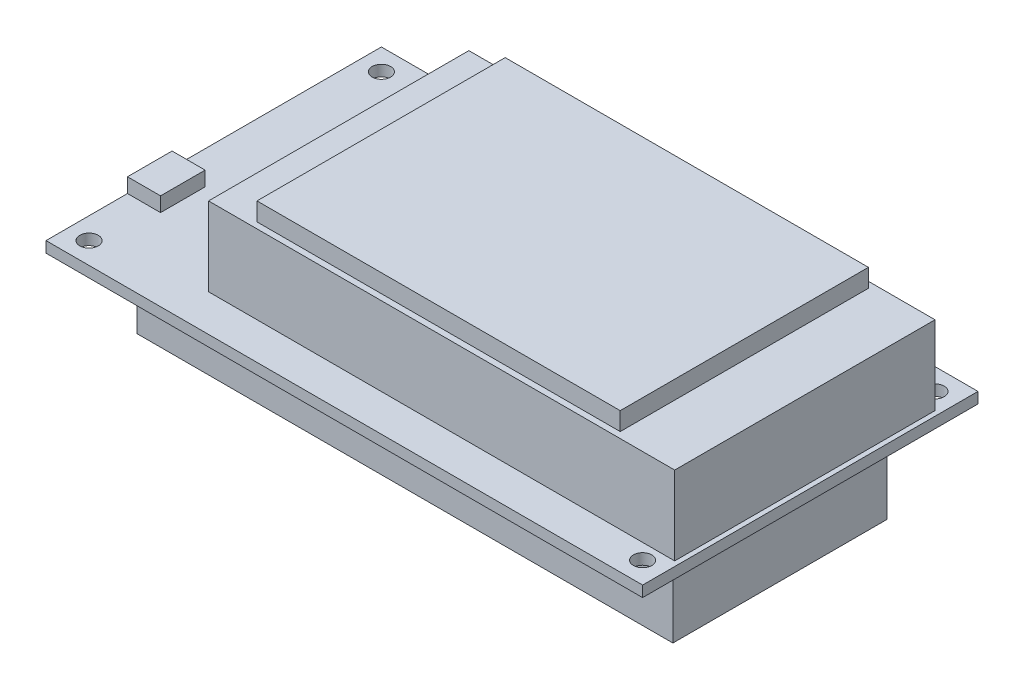
ISO-10303-21;
HEADER;
FILE_DESCRIPTION(('STEP AP214'),'2;1');
FILE_NAME('part.step','',(''),(''),'','','');
FILE_SCHEMA(('AUTOMOTIVE_DESIGN { 1 0 10303 214 1 1 1 1 }'));
ENDSEC;
DATA;
#1=APPLICATION_CONTEXT('core data for automotive mechanical design processes');
#2=APPLICATION_PROTOCOL_DEFINITION('international standard','automotive_design',2000,#1);
#3=PRODUCT_CONTEXT('',#1,'mechanical');
#4=PRODUCT('Part','Part','',(#3));
#5=PRODUCT_RELATED_PRODUCT_CATEGORY('part','',(#4));
#6=PRODUCT_DEFINITION_FORMATION('','',#4);
#7=PRODUCT_DEFINITION_CONTEXT('part definition',#1,'design');
#8=PRODUCT_DEFINITION('design','',#6,#7);
#9=PRODUCT_DEFINITION_SHAPE('','',#8);
#10=(LENGTH_UNIT() NAMED_UNIT(*) SI_UNIT(.MILLI.,.METRE.));
#11=(NAMED_UNIT(*) PLANE_ANGLE_UNIT() SI_UNIT($,.RADIAN.));
#12=(NAMED_UNIT(*) SI_UNIT($,.STERADIAN.) SOLID_ANGLE_UNIT());
#13=UNCERTAINTY_MEASURE_WITH_UNIT(LENGTH_MEASURE(1.E-05),#10,'distance_accuracy_value','');
#14=(GEOMETRIC_REPRESENTATION_CONTEXT(3) GLOBAL_UNCERTAINTY_ASSIGNED_CONTEXT((#13)) GLOBAL_UNIT_ASSIGNED_CONTEXT((#10,
#11,#12)) REPRESENTATION_CONTEXT('',''));
#15=CARTESIAN_POINT('',(0.,0.,0.));
#16=DIRECTION('',(0.,0.,1.));
#17=DIRECTION('',(1.,0.,0.));
#18=AXIS2_PLACEMENT_3D('',#15,#16,#17);
#19=CARTESIAN_POINT('',(0.,4.2,-13.46));
#20=DIRECTION('',(1.,0.,0.));
#21=DIRECTION('',(0.,0.,-1.));
#22=AXIS2_PLACEMENT_3D('',#19,#20,#21);
#23=PLANE('',#22);
#24=DIRECTION('',(0.,0.,1.));
#25=VECTOR('',#24,1.);
#26=CARTESIAN_POINT('',(0.,1.8,-13.46));
#27=LINE('',#26,#25);
#28=CARTESIAN_POINT('',(0.,1.8,-20.826));
#29=VERTEX_POINT('',#28);
#30=CARTESIAN_POINT('',(0.,1.8,-13.46));
#31=VERTEX_POINT('',#30);
#32=EDGE_CURVE('E110',#29,#31,#27,.T.);
#33=ORIENTED_EDGE('',*,*,#32,.T.);
#34=DIRECTION('',(0.,-1.,0.));
#35=VECTOR('',#34,1.);
#36=CARTESIAN_POINT('',(0.,4.2,-13.46));
#37=LINE('',#36,#35);
#38=CARTESIAN_POINT('',(0.,4.2,-13.46));
#39=VERTEX_POINT('',#38);
#40=EDGE_CURVE('E12',#39,#31,#37,.T.);
#41=ORIENTED_EDGE('',*,*,#40,.F.);
#42=DIRECTION('',(0.,0.,1.));
#43=VECTOR('',#42,1.);
#44=CARTESIAN_POINT('',(0.,4.2,-13.46));
#45=LINE('',#44,#43);
#46=CARTESIAN_POINT('',(0.,4.2,-20.826));
#47=VERTEX_POINT('',#46);
#48=EDGE_CURVE('E98',#47,#39,#45,.T.);
#49=ORIENTED_EDGE('',*,*,#48,.F.);
#50=DIRECTION('',(0.,-1.,0.));
#51=VECTOR('',#50,1.);
#52=CARTESIAN_POINT('',(0.,4.2,-20.826));
#53=LINE('',#52,#51);
#54=EDGE_CURVE('E106',#47,#29,#53,.T.);
#55=ORIENTED_EDGE('',*,*,#54,.T.);
#56=EDGE_LOOP('',(#33,#41,#49,#55));
#57=FACE_BOUND('',#56,.T.);
#58=ADVANCED_FACE('F47',(#57),#23,.F.);
#59=CARTESIAN_POINT('',(0.,4.2,-13.46));
#60=DIRECTION('',(0.,0.,-1.));
#61=DIRECTION('',(-1.,0.,0.));
#62=AXIS2_PLACEMENT_3D('',#59,#60,#61);
#63=PLANE('',#62);
#64=DIRECTION('',(1.,0.,0.));
#65=VECTOR('',#64,1.);
#66=CARTESIAN_POINT('',(0.,1.8,-13.46));
#67=LINE('',#66,#65);
#68=CARTESIAN_POINT('',(5.46,1.8,-13.46));
#69=VERTEX_POINT('',#68);
#70=EDGE_CURVE('E102',#31,#69,#67,.T.);
#71=ORIENTED_EDGE('',*,*,#70,.T.);
#72=DIRECTION('',(0.,-1.,0.));
#73=VECTOR('',#72,1.);
#74=CARTESIAN_POINT('',(5.46,4.2,-13.46));
#75=LINE('',#74,#73);
#76=CARTESIAN_POINT('',(5.46,4.2,-13.46));
#77=VERTEX_POINT('',#76);
#78=EDGE_CURVE('E55',#77,#69,#75,.T.);
#79=ORIENTED_EDGE('',*,*,#78,.F.);
#80=DIRECTION('',(1.,0.,0.));
#81=VECTOR('',#80,1.);
#82=CARTESIAN_POINT('',(0.,4.2,-13.46));
#83=LINE('',#82,#81);
#84=EDGE_CURVE('E93',#39,#77,#83,.T.);
#85=ORIENTED_EDGE('',*,*,#84,.F.);
#86=ORIENTED_EDGE('',*,*,#40,.T.);
#87=EDGE_LOOP('',(#71,#79,#85,#86));
#88=FACE_BOUND('',#87,.T.);
#89=ADVANCED_FACE('F101',(#88),#63,.F.);
#90=CARTESIAN_POINT('',(5.46,4.2,-13.46));
#91=DIRECTION('',(-1.,0.,0.));
#92=DIRECTION('',(0.,0.,1.));
#93=AXIS2_PLACEMENT_3D('',#90,#91,#92);
#94=PLANE('',#93);
#95=DIRECTION('',(0.,0.,-1.));
#96=VECTOR('',#95,1.);
#97=CARTESIAN_POINT('',(5.46,1.8,-13.46));
#98=LINE('',#97,#96);
#99=CARTESIAN_POINT('',(5.46,1.8,-20.826));
#100=VERTEX_POINT('',#99);
#101=EDGE_CURVE('E80',#69,#100,#98,.T.);
#102=ORIENTED_EDGE('',*,*,#101,.T.);
#103=DIRECTION('',(0.,-1.,0.));
#104=VECTOR('',#103,1.);
#105=CARTESIAN_POINT('',(5.46,4.2,-20.826));
#106=LINE('',#105,#104);
#107=CARTESIAN_POINT('',(5.46,4.2,-20.826));
#108=VERTEX_POINT('',#107);
#109=EDGE_CURVE('E103',#108,#100,#106,.T.);
#110=ORIENTED_EDGE('',*,*,#109,.F.);
#111=DIRECTION('',(0.,0.,-1.));
#112=VECTOR('',#111,1.);
#113=CARTESIAN_POINT('',(5.46,4.2,-13.46));
#114=LINE('',#113,#112);
#115=EDGE_CURVE('E96',#77,#108,#114,.T.);
#116=ORIENTED_EDGE('',*,*,#115,.F.);
#117=ORIENTED_EDGE('',*,*,#78,.T.);
#118=EDGE_LOOP('',(#102,#110,#116,#117));
#119=FACE_BOUND('',#118,.T.);
#120=ADVANCED_FACE('F104',(#119),#94,.F.);
#121=CARTESIAN_POINT('',(0.,4.2,-20.826));
#122=DIRECTION('',(0.,0.,1.));
#123=DIRECTION('',(1.,0.,0.));
#124=AXIS2_PLACEMENT_3D('',#121,#122,#123);
#125=PLANE('',#124);
#126=DIRECTION('',(-1.,0.,0.));
#127=VECTOR('',#126,1.);
#128=CARTESIAN_POINT('',(0.,1.8,-20.826));
#129=LINE('',#128,#127);
#130=EDGE_CURVE('E86',#100,#29,#129,.T.);
#131=ORIENTED_EDGE('',*,*,#130,.T.);
#132=ORIENTED_EDGE('',*,*,#54,.F.);
#133=DIRECTION('',(-1.,0.,0.));
#134=VECTOR('',#133,1.);
#135=CARTESIAN_POINT('',(0.,4.2,-20.826));
#136=LINE('',#135,#134);
#137=EDGE_CURVE('E63',#108,#47,#136,.T.);
#138=ORIENTED_EDGE('',*,*,#137,.F.);
#139=ORIENTED_EDGE('',*,*,#109,.T.);
#140=EDGE_LOOP('',(#131,#132,#138,#139));
#141=FACE_BOUND('',#140,.T.);
#142=ADVANCED_FACE('F117',(#141),#125,.F.);
#143=CARTESIAN_POINT('',(0.,4.2,0.));
#144=DIRECTION('',(0.,-1.,0.));
#145=DIRECTION('',(0.,0.,-1.));
#146=AXIS2_PLACEMENT_3D('',#143,#144,#145);
#147=PLANE('',#146);
#148=ORIENTED_EDGE('',*,*,#48,.T.);
#149=ORIENTED_EDGE('',*,*,#84,.T.);
#150=ORIENTED_EDGE('',*,*,#115,.T.);
#151=ORIENTED_EDGE('',*,*,#137,.T.);
#152=EDGE_LOOP('',(#148,#149,#150,#151));
#153=FACE_BOUND('',#152,.T.);
#154=ADVANCED_FACE('F94',(#153),#147,.F.);
#155=CARTESIAN_POINT('',(0.,1.8,0.));
#156=DIRECTION('',(0.,-1.,0.));
#157=DIRECTION('',(0.,0.,-1.));
#158=AXIS2_PLACEMENT_3D('',#155,#156,#157);
#159=PLANE('',#158);
#160=ORIENTED_EDGE('',*,*,#32,.F.);
#161=ORIENTED_EDGE('',*,*,#130,.F.);
#162=ORIENTED_EDGE('',*,*,#101,.F.);
#163=ORIENTED_EDGE('',*,*,#70,.F.);
#164=EDGE_LOOP('',(#160,#161,#162,#163));
#165=FACE_BOUND('',#164,.T.);
#166=ADVANCED_FACE('F120',(#165),#159,.T.);
#167=CLOSED_SHELL('',(#58,#89,#120,#142,#154,#166));
#168=MANIFOLD_SOLID_BREP('B2',#167);
#169=CARTESIAN_POINT('',(0.,0.,0.));
#170=DIRECTION('',(0.,-1.,0.));
#171=DIRECTION('',(0.,0.,-1.));
#172=AXIS2_PLACEMENT_3D('',#169,#170,#171);
#173=PLANE('',#172);
#174=CARTESIAN_POINT('',(94.9959999999998,0.,-51.8460000000013));
#175=DIRECTION('',(0.,1.,0.));
#176=DIRECTION('',(0.,0.,1.));
#177=AXIS2_PLACEMENT_3D('',#174,#175,#176);
#178=CIRCLE('',#177,1.52399999999999);
#179=CARTESIAN_POINT('',(94.9959999999998,0.,-50.3220000000013));
#180=VERTEX_POINT('',#179);
#181=EDGE_CURVE('E380',#180,#180,#178,.T.);
#182=ORIENTED_EDGE('',*,*,#181,.T.);
#183=EDGE_LOOP('',(#182));
#184=FACE_BOUND('',#183,.T.);
#185=CARTESIAN_POINT('',(3.556,0.,-3.556));
#186=DIRECTION('',(0.,1.,0.));
#187=DIRECTION('',(0.,0.,1.));
#188=AXIS2_PLACEMENT_3D('',#185,#186,#187);
#189=CIRCLE('',#188,1.524);
#190=CARTESIAN_POINT('',(3.556,0.,-2.032));
#191=VERTEX_POINT('',#190);
#192=EDGE_CURVE('E392',#191,#191,#189,.T.);
#193=ORIENTED_EDGE('',*,*,#192,.T.);
#194=EDGE_LOOP('',(#193));
#195=FACE_BOUND('',#194,.T.);
#196=DIRECTION('',(0.,0.,1.));
#197=VECTOR('',#196,1.);
#198=CARTESIAN_POINT('',(0.,0.,0.));
#199=LINE('',#198,#197);
#200=CARTESIAN_POINT('',(0.,0.,-55.4));
#201=VERTEX_POINT('',#200);
#202=CARTESIAN_POINT('',(0.,0.,0.));
#203=VERTEX_POINT('',#202);
#204=EDGE_CURVE('E398',#201,#203,#199,.T.);
#205=ORIENTED_EDGE('',*,*,#204,.F.);
#206=DIRECTION('',(-1.,0.,0.));
#207=VECTOR('',#206,1.);
#208=CARTESIAN_POINT('',(0.,0.,-55.4));
#209=LINE('',#208,#207);
#210=CARTESIAN_POINT('',(98.55,0.,-55.4));
#211=VERTEX_POINT('',#210);
#212=EDGE_CURVE('E405',#211,#201,#209,.T.);
#213=ORIENTED_EDGE('',*,*,#212,.F.);
#214=DIRECTION('',(0.,0.,-1.));
#215=VECTOR('',#214,1.);
#216=CARTESIAN_POINT('',(98.55,0.,0.));
#217=LINE('',#216,#215);
#218=CARTESIAN_POINT('',(98.55,0.,0.));
#219=VERTEX_POINT('',#218);
#220=EDGE_CURVE('E416',#219,#211,#217,.T.);
#221=ORIENTED_EDGE('',*,*,#220,.F.);
#222=DIRECTION('',(1.,0.,0.));
#223=VECTOR('',#222,1.);
#224=CARTESIAN_POINT('',(0.,0.,0.));
#225=LINE('',#224,#223);
#226=EDGE_CURVE('E414',#203,#219,#225,.T.);
#227=ORIENTED_EDGE('',*,*,#226,.F.);
#228=EDGE_LOOP('',(#205,#213,#221,#227));
#229=FACE_BOUND('',#228,.T.);
#230=CARTESIAN_POINT('',(94.996,0.,-3.55600000000128));
#231=DIRECTION('',(0.,1.,0.));
#232=DIRECTION('',(0.,0.,1.));
#233=AXIS2_PLACEMENT_3D('',#230,#231,#232);
#234=CIRCLE('',#233,1.52399999999999);
#235=CARTESIAN_POINT('',(94.996,0.,-2.03200000000129));
#236=VERTEX_POINT('',#235);
#237=EDGE_CURVE('E386',#236,#236,#234,.T.);
#238=ORIENTED_EDGE('',*,*,#237,.T.);
#239=EDGE_LOOP('',(#238));
#240=FACE_BOUND('',#239,.T.);
#241=CARTESIAN_POINT('',(3.55599999999984,0.,-51.846));
#242=DIRECTION('',(0.,1.,0.));
#243=DIRECTION('',(0.,0.,1.));
#244=AXIS2_PLACEMENT_3D('',#241,#242,#243);
#245=CIRCLE('',#244,1.524);
#246=CARTESIAN_POINT('',(3.55599999999984,0.,-50.322));
#247=VERTEX_POINT('',#246);
#248=EDGE_CURVE('E376',#247,#247,#245,.T.);
#249=ORIENTED_EDGE('',*,*,#248,.T.);
#250=EDGE_LOOP('',(#249));
#251=FACE_BOUND('',#250,.T.);
#252=DIRECTION('',(1.,0.,0.));
#253=VECTOR('',#252,1.);
#254=CARTESIAN_POINT('',(5.,0.,-45.4));
#255=LINE('',#254,#253);
#256=CARTESIAN_POINT('',(5.,0.,-45.4));
#257=VERTEX_POINT('',#256);
#258=CARTESIAN_POINT('',(93.55,0.,-45.4));
#259=VERTEX_POINT('',#258);
#260=EDGE_CURVE('E692',#257,#259,#255,.T.);
#261=ORIENTED_EDGE('',*,*,#260,.F.);
#262=DIRECTION('',(0.,0.,-1.));
#263=VECTOR('',#262,1.);
#264=CARTESIAN_POINT('',(4.99999999999999,0.,-10.));
#265=LINE('',#264,#263);
#266=CARTESIAN_POINT('',(4.99999999999999,0.,-10.));
#267=VERTEX_POINT('',#266);
#268=EDGE_CURVE('E307',#267,#257,#265,.T.);
#269=ORIENTED_EDGE('',*,*,#268,.F.);
#270=DIRECTION('',(-1.,0.,0.));
#271=VECTOR('',#270,1.);
#272=CARTESIAN_POINT('',(4.99999999999999,0.,-10.));
#273=LINE('',#272,#271);
#274=CARTESIAN_POINT('',(93.55,0.,-10.));
#275=VERTEX_POINT('',#274);
#276=EDGE_CURVE('E303',#275,#267,#273,.T.);
#277=ORIENTED_EDGE('',*,*,#276,.F.);
#278=DIRECTION('',(0.,0.,1.));
#279=VECTOR('',#278,1.);
#280=CARTESIAN_POINT('',(93.55,0.,-10.));
#281=LINE('',#280,#279);
#282=EDGE_CURVE('E694',#259,#275,#281,.T.);
#283=ORIENTED_EDGE('',*,*,#282,.F.);
#284=EDGE_LOOP('',(#261,#269,#277,#283));
#285=FACE_BOUND('',#284,.T.);
#286=ADVANCED_FACE('F171',(#184,#195,#229,#240,#251,#285),#173,.T.);
#287=CARTESIAN_POINT('',(0.,14.8,0.));
#288=DIRECTION('',(0.,-1.,0.));
#289=DIRECTION('',(0.,0.,-1.));
#290=AXIS2_PLACEMENT_3D('',#287,#288,#289);
#291=PLANE('',#290);
#292=DIRECTION('',(0.,0.,-1.));
#293=VECTOR('',#292,1.);
#294=CARTESIAN_POINT('',(97.75,14.8,-49.1));
#295=LINE('',#294,#293);
#296=CARTESIAN_POINT('',(97.75,14.8,-6.1));
#297=VERTEX_POINT('',#296);
#298=CARTESIAN_POINT('',(97.75,14.8,-49.1));
#299=VERTEX_POINT('',#298);
#300=EDGE_CURVE('E344',#297,#299,#295,.T.);
#301=ORIENTED_EDGE('',*,*,#300,.T.);
#302=DIRECTION('',(-1.,0.,0.));
#303=VECTOR('',#302,1.);
#304=CARTESIAN_POINT('',(97.75,14.8,-49.1));
#305=LINE('',#304,#303);
#306=CARTESIAN_POINT('',(20.75,14.8,-49.1));
#307=VERTEX_POINT('',#306);
#308=EDGE_CURVE('E347',#299,#307,#305,.T.);
#309=ORIENTED_EDGE('',*,*,#308,.T.);
#310=DIRECTION('',(0.,0.,1.));
#311=VECTOR('',#310,1.);
#312=CARTESIAN_POINT('',(20.75,14.8,-49.1));
#313=LINE('',#312,#311);
#314=CARTESIAN_POINT('',(20.75,14.8,-6.09999999999999));
#315=VERTEX_POINT('',#314);
#316=EDGE_CURVE('E350',#307,#315,#313,.T.);
#317=ORIENTED_EDGE('',*,*,#316,.T.);
#318=DIRECTION('',(1.,0.,0.));
#319=VECTOR('',#318,1.);
#320=CARTESIAN_POINT('',(97.75,14.8,-6.1));
#321=LINE('',#320,#319);
#322=EDGE_CURVE('E352',#315,#297,#321,.T.);
#323=ORIENTED_EDGE('',*,*,#322,.T.);
#324=EDGE_LOOP('',(#301,#309,#317,#323));
#325=FACE_BOUND('',#324,.T.);
#326=DIRECTION('',(0.,0.,1.));
#327=VECTOR('',#326,1.);
#328=CARTESIAN_POINT('',(27.75,14.8,-48.1));
#329=LINE('',#328,#327);
#330=CARTESIAN_POINT('',(27.75,14.8,-48.1));
#331=VERTEX_POINT('',#330);
#332=CARTESIAN_POINT('',(27.75,14.8,-7.09999999999999));
#333=VERTEX_POINT('',#332);
#334=EDGE_CURVE('E194',#331,#333,#329,.T.);
#335=ORIENTED_EDGE('',*,*,#334,.F.);
#336=DIRECTION('',(-1.,0.,0.));
#337=VECTOR('',#336,1.);
#338=CARTESIAN_POINT('',(27.75,14.8,-48.1));
#339=LINE('',#338,#337);
#340=CARTESIAN_POINT('',(87.75,14.8,-48.1));
#341=VERTEX_POINT('',#340);
#342=EDGE_CURVE('E319',#341,#331,#339,.T.);
#343=ORIENTED_EDGE('',*,*,#342,.F.);
#344=DIRECTION('',(0.,0.,-1.));
#345=VECTOR('',#344,1.);
#346=CARTESIAN_POINT('',(87.75,14.8,-48.1));
#347=LINE('',#346,#345);
#348=CARTESIAN_POINT('',(87.75,14.8,-7.09999999999999));
#349=VERTEX_POINT('',#348);
#350=EDGE_CURVE('E328',#349,#341,#347,.T.);
#351=ORIENTED_EDGE('',*,*,#350,.F.);
#352=DIRECTION('',(1.,0.,0.));
#353=VECTOR('',#352,1.);
#354=CARTESIAN_POINT('',(27.75,14.8,-7.09999999999999));
#355=LINE('',#354,#353);
#356=EDGE_CURVE('E310',#333,#349,#355,.T.);
#357=ORIENTED_EDGE('',*,*,#356,.F.);
#358=EDGE_LOOP('',(#335,#343,#351,#357));
#359=FACE_BOUND('',#358,.T.);
#360=ADVANCED_FACE('F453',(#325,#359),#291,.F.);
#361=CARTESIAN_POINT('',(0.,1.8,0.));
#362=DIRECTION('',(0.,-1.,0.));
#363=DIRECTION('',(0.,0.,-1.));
#364=AXIS2_PLACEMENT_3D('',#361,#362,#363);
#365=PLANE('',#364);
#366=CARTESIAN_POINT('',(3.55599999999984,1.8,-51.846));
#367=DIRECTION('',(0.,1.,0.));
#368=DIRECTION('',(0.,0.,1.));
#369=AXIS2_PLACEMENT_3D('',#366,#367,#368);
#370=CIRCLE('',#369,1.524);
#371=CARTESIAN_POINT('',(3.55599999999984,1.8,-50.322));
#372=VERTEX_POINT('',#371);
#373=EDGE_CURVE('E377',#372,#372,#370,.T.);
#374=ORIENTED_EDGE('',*,*,#373,.F.);
#375=EDGE_LOOP('',(#374));
#376=FACE_BOUND('',#375,.T.);
#377=CARTESIAN_POINT('',(94.9959999999998,1.8,-51.8460000000013));
#378=DIRECTION('',(0.,1.,0.));
#379=DIRECTION('',(0.,0.,1.));
#380=AXIS2_PLACEMENT_3D('',#377,#378,#379);
#381=CIRCLE('',#380,1.52399999999999);
#382=CARTESIAN_POINT('',(94.9959999999998,1.8,-50.3220000000013));
#383=VERTEX_POINT('',#382);
#384=EDGE_CURVE('E383',#383,#383,#381,.T.);
#385=ORIENTED_EDGE('',*,*,#384,.F.);
#386=EDGE_LOOP('',(#385));
#387=FACE_BOUND('',#386,.T.);
#388=CARTESIAN_POINT('',(94.996,1.8,-3.55600000000128));
#389=DIRECTION('',(0.,1.,0.));
#390=DIRECTION('',(0.,0.,1.));
#391=AXIS2_PLACEMENT_3D('',#388,#389,#390);
#392=CIRCLE('',#391,1.52399999999999);
#393=CARTESIAN_POINT('',(94.996,1.8,-2.03200000000129));
#394=VERTEX_POINT('',#393);
#395=EDGE_CURVE('E389',#394,#394,#392,.T.);
#396=ORIENTED_EDGE('',*,*,#395,.F.);
#397=EDGE_LOOP('',(#396));
#398=FACE_BOUND('',#397,.T.);
#399=CARTESIAN_POINT('',(3.556,1.8,-3.556));
#400=DIRECTION('',(0.,1.,0.));
#401=DIRECTION('',(0.,0.,1.));
#402=AXIS2_PLACEMENT_3D('',#399,#400,#401);
#403=CIRCLE('',#402,1.524);
#404=CARTESIAN_POINT('',(3.556,1.8,-2.032));
#405=VERTEX_POINT('',#404);
#406=EDGE_CURVE('E395',#405,#405,#403,.T.);
#407=ORIENTED_EDGE('',*,*,#406,.F.);
#408=EDGE_LOOP('',(#407));
#409=FACE_BOUND('',#408,.T.);
#410=DIRECTION('',(0.,0.,1.));
#411=VECTOR('',#410,1.);
#412=CARTESIAN_POINT('',(0.,1.8,0.));
#413=LINE('',#412,#411);
#414=CARTESIAN_POINT('',(0.,1.8,-55.4));
#415=VERTEX_POINT('',#414);
#416=CARTESIAN_POINT('',(0.,1.8,0.));
#417=VERTEX_POINT('',#416);
#418=EDGE_CURVE('E401',#415,#417,#413,.T.);
#419=ORIENTED_EDGE('',*,*,#418,.T.);
#420=DIRECTION('',(1.,0.,0.));
#421=VECTOR('',#420,1.);
#422=CARTESIAN_POINT('',(0.,1.8,0.));
#423=LINE('',#422,#421);
#424=CARTESIAN_POINT('',(98.55,1.8,0.));
#425=VERTEX_POINT('',#424);
#426=EDGE_CURVE('E404',#417,#425,#423,.T.);
#427=ORIENTED_EDGE('',*,*,#426,.T.);
#428=DIRECTION('',(0.,0.,-1.));
#429=VECTOR('',#428,1.);
#430=CARTESIAN_POINT('',(98.55,1.8,0.));
#431=LINE('',#430,#429);
#432=CARTESIAN_POINT('',(98.55,1.8,-55.4));
#433=VERTEX_POINT('',#432);
#434=EDGE_CURVE('E407',#425,#433,#431,.T.);
#435=ORIENTED_EDGE('',*,*,#434,.T.);
#436=DIRECTION('',(-1.,0.,0.));
#437=VECTOR('',#436,1.);
#438=CARTESIAN_POINT('',(0.,1.8,-55.4));
#439=LINE('',#438,#437);
#440=EDGE_CURVE('E409',#433,#415,#439,.T.);
#441=ORIENTED_EDGE('',*,*,#440,.T.);
#442=EDGE_LOOP('',(#419,#427,#435,#441));
#443=FACE_BOUND('',#442,.T.);
#444=DIRECTION('',(0.,0.,-1.));
#445=VECTOR('',#444,1.);
#446=CARTESIAN_POINT('',(97.75,1.8,-49.1));
#447=LINE('',#446,#445);
#448=CARTESIAN_POINT('',(97.75,1.8,-6.1));
#449=VERTEX_POINT('',#448);
#450=CARTESIAN_POINT('',(97.75,1.8,-49.1));
#451=VERTEX_POINT('',#450);
#452=EDGE_CURVE('E343',#449,#451,#447,.T.);
#453=ORIENTED_EDGE('',*,*,#452,.F.);
#454=DIRECTION('',(1.,0.,0.));
#455=VECTOR('',#454,1.);
#456=CARTESIAN_POINT('',(97.75,1.8,-6.1));
#457=LINE('',#456,#455);
#458=CARTESIAN_POINT('',(20.75,1.8,-6.09999999999999));
#459=VERTEX_POINT('',#458);
#460=EDGE_CURVE('E348',#459,#449,#457,.T.);
#461=ORIENTED_EDGE('',*,*,#460,.F.);
#462=DIRECTION('',(0.,0.,1.));
#463=VECTOR('',#462,1.);
#464=CARTESIAN_POINT('',(20.75,1.8,-49.1));
#465=LINE('',#464,#463);
#466=CARTESIAN_POINT('',(20.75,1.8,-49.1));
#467=VERTEX_POINT('',#466);
#468=EDGE_CURVE('E360',#467,#459,#465,.T.);
#469=ORIENTED_EDGE('',*,*,#468,.F.);
#470=DIRECTION('',(-1.,0.,0.));
#471=VECTOR('',#470,1.);
#472=CARTESIAN_POINT('',(97.75,1.8,-49.1));
#473=LINE('',#472,#471);
#474=EDGE_CURVE('E357',#451,#467,#473,.T.);
#475=ORIENTED_EDGE('',*,*,#474,.F.);
#476=EDGE_LOOP('',(#453,#461,#469,#475));
#477=FACE_BOUND('',#476,.T.);
#478=ADVANCED_FACE('F443',(#376,#387,#398,#409,#443,#477),#365,.F.);
#479=CARTESIAN_POINT('',(0.,1.8,0.));
#480=DIRECTION('',(1.,0.,0.));
#481=DIRECTION('',(0.,0.,-1.));
#482=AXIS2_PLACEMENT_3D('',#479,#480,#481);
#483=PLANE('',#482);
#484=ORIENTED_EDGE('',*,*,#204,.T.);
#485=DIRECTION('',(0.,-1.,0.));
#486=VECTOR('',#485,1.);
#487=CARTESIAN_POINT('',(0.,1.8,0.));
#488=LINE('',#487,#486);
#489=EDGE_CURVE('E45',#417,#203,#488,.T.);
#490=ORIENTED_EDGE('',*,*,#489,.F.);
#491=ORIENTED_EDGE('',*,*,#418,.F.);
#492=DIRECTION('',(0.,-1.,0.));
#493=VECTOR('',#492,1.);
#494=CARTESIAN_POINT('',(0.,1.8,-55.4));
#495=LINE('',#494,#493);
#496=EDGE_CURVE('E411',#415,#201,#495,.T.);
#497=ORIENTED_EDGE('',*,*,#496,.T.);
#498=EDGE_LOOP('',(#484,#490,#491,#497));
#499=FACE_BOUND('',#498,.T.);
#500=ADVANCED_FACE('F173',(#499),#483,.F.);
#501=CARTESIAN_POINT('',(0.,1.8,0.));
#502=DIRECTION('',(0.,0.,-1.));
#503=DIRECTION('',(-1.,0.,0.));
#504=AXIS2_PLACEMENT_3D('',#501,#502,#503);
#505=PLANE('',#504);
#506=ORIENTED_EDGE('',*,*,#226,.T.);
#507=DIRECTION('',(0.,-1.,0.));
#508=VECTOR('',#507,1.);
#509=CARTESIAN_POINT('',(98.55,1.8,0.));
#510=LINE('',#509,#508);
#511=EDGE_CURVE('E179',#425,#219,#510,.T.);
#512=ORIENTED_EDGE('',*,*,#511,.F.);
#513=ORIENTED_EDGE('',*,*,#426,.F.);
#514=ORIENTED_EDGE('',*,*,#489,.T.);
#515=EDGE_LOOP('',(#506,#512,#513,#514));
#516=FACE_BOUND('',#515,.T.);
#517=ADVANCED_FACE('F445',(#516),#505,.F.);
#518=CARTESIAN_POINT('',(98.55,1.8,0.));
#519=DIRECTION('',(-1.,0.,0.));
#520=DIRECTION('',(0.,0.,1.));
#521=AXIS2_PLACEMENT_3D('',#518,#519,#520);
#522=PLANE('',#521);
#523=ORIENTED_EDGE('',*,*,#220,.T.);
#524=DIRECTION('',(0.,-1.,0.));
#525=VECTOR('',#524,1.);
#526=CARTESIAN_POINT('',(98.55,1.8,-55.4));
#527=LINE('',#526,#525);
#528=EDGE_CURVE('E421',#433,#211,#527,.T.);
#529=ORIENTED_EDGE('',*,*,#528,.F.);
#530=ORIENTED_EDGE('',*,*,#434,.F.);
#531=ORIENTED_EDGE('',*,*,#511,.T.);
#532=EDGE_LOOP('',(#523,#529,#530,#531));
#533=FACE_BOUND('',#532,.T.);
#534=ADVANCED_FACE('F428',(#533),#522,.F.);
#535=CARTESIAN_POINT('',(0.,1.8,-55.4));
#536=DIRECTION('',(0.,0.,1.));
#537=DIRECTION('',(1.,0.,0.));
#538=AXIS2_PLACEMENT_3D('',#535,#536,#537);
#539=PLANE('',#538);
#540=ORIENTED_EDGE('',*,*,#212,.T.);
#541=ORIENTED_EDGE('',*,*,#496,.F.);
#542=ORIENTED_EDGE('',*,*,#440,.F.);
#543=ORIENTED_EDGE('',*,*,#528,.T.);
#544=EDGE_LOOP('',(#540,#541,#542,#543));
#545=FACE_BOUND('',#544,.T.);
#546=ADVANCED_FACE('F437',(#545),#539,.F.);
#547=CARTESIAN_POINT('',(3.556,1.8,-3.556));
#548=DIRECTION('',(0.,-1.,0.));
#549=DIRECTION('',(0.,0.,-1.));
#550=AXIS2_PLACEMENT_3D('',#547,#548,#549);
#551=CYLINDRICAL_SURFACE('',#550,1.524);
#552=ORIENTED_EDGE('',*,*,#406,.T.);
#553=EDGE_LOOP('',(#552));
#554=FACE_BOUND('',#553,.T.);
#555=ORIENTED_EDGE('',*,*,#192,.F.);
#556=EDGE_LOOP('',(#555));
#557=FACE_BOUND('',#556,.T.);
#558=ADVANCED_FACE('F466',(#554,#557),#551,.F.);
#559=CARTESIAN_POINT('',(94.996,1.8,-3.55600000000128));
#560=DIRECTION('',(0.,-1.,0.));
#561=DIRECTION('',(0.,0.,-1.));
#562=AXIS2_PLACEMENT_3D('',#559,#560,#561);
#563=CYLINDRICAL_SURFACE('',#562,1.52399999999999);
#564=ORIENTED_EDGE('',*,*,#395,.T.);
#565=EDGE_LOOP('',(#564));
#566=FACE_BOUND('',#565,.T.);
#567=ORIENTED_EDGE('',*,*,#237,.F.);
#568=EDGE_LOOP('',(#567));
#569=FACE_BOUND('',#568,.T.);
#570=ADVANCED_FACE('F470',(#566,#569),#563,.F.);
#571=CARTESIAN_POINT('',(94.9959999999998,1.8,-51.8460000000013));
#572=DIRECTION('',(0.,-1.,0.));
#573=DIRECTION('',(0.,0.,-1.));
#574=AXIS2_PLACEMENT_3D('',#571,#572,#573);
#575=CYLINDRICAL_SURFACE('',#574,1.52399999999999);
#576=ORIENTED_EDGE('',*,*,#384,.T.);
#577=EDGE_LOOP('',(#576));
#578=FACE_BOUND('',#577,.T.);
#579=ORIENTED_EDGE('',*,*,#181,.F.);
#580=EDGE_LOOP('',(#579));
#581=FACE_BOUND('',#580,.T.);
#582=ADVANCED_FACE('F475',(#578,#581),#575,.F.);
#583=CARTESIAN_POINT('',(3.55599999999984,1.8,-51.846));
#584=DIRECTION('',(0.,-1.,0.));
#585=DIRECTION('',(0.,0.,-1.));
#586=AXIS2_PLACEMENT_3D('',#583,#584,#585);
#587=CYLINDRICAL_SURFACE('',#586,1.524);
#588=ORIENTED_EDGE('',*,*,#373,.T.);
#589=EDGE_LOOP('',(#588));
#590=FACE_BOUND('',#589,.T.);
#591=ORIENTED_EDGE('',*,*,#248,.F.);
#592=EDGE_LOOP('',(#591));
#593=FACE_BOUND('',#592,.T.);
#594=ADVANCED_FACE('F482',(#590,#593),#587,.F.);
#595=CARTESIAN_POINT('',(97.75,14.8,-49.1));
#596=DIRECTION('',(-1.,0.,0.));
#597=DIRECTION('',(0.,0.,1.));
#598=AXIS2_PLACEMENT_3D('',#595,#596,#597);
#599=PLANE('',#598);
#600=ORIENTED_EDGE('',*,*,#452,.T.);
#601=DIRECTION('',(0.,-1.,0.));
#602=VECTOR('',#601,1.);
#603=CARTESIAN_POINT('',(97.75,14.8,-49.1));
#604=LINE('',#603,#602);
#605=EDGE_CURVE('E373',#299,#451,#604,.T.);
#606=ORIENTED_EDGE('',*,*,#605,.F.);
#607=ORIENTED_EDGE('',*,*,#300,.F.);
#608=DIRECTION('',(0.,-1.,0.));
#609=VECTOR('',#608,1.);
#610=CARTESIAN_POINT('',(97.75,14.8,-6.1));
#611=LINE('',#610,#609);
#612=EDGE_CURVE('E354',#297,#449,#611,.T.);
#613=ORIENTED_EDGE('',*,*,#612,.T.);
#614=EDGE_LOOP('',(#600,#606,#607,#613));
#615=FACE_BOUND('',#614,.T.);
#616=ADVANCED_FACE('F486',(#615),#599,.F.);
#617=CARTESIAN_POINT('',(97.75,14.8,-49.1));
#618=DIRECTION('',(0.,0.,1.));
#619=DIRECTION('',(1.,0.,0.));
#620=AXIS2_PLACEMENT_3D('',#617,#618,#619);
#621=PLANE('',#620);
#622=ORIENTED_EDGE('',*,*,#474,.T.);
#623=DIRECTION('',(0.,-1.,0.));
#624=VECTOR('',#623,1.);
#625=CARTESIAN_POINT('',(20.75,14.8,-49.1));
#626=LINE('',#625,#624);
#627=EDGE_CURVE('E370',#307,#467,#626,.T.);
#628=ORIENTED_EDGE('',*,*,#627,.F.);
#629=ORIENTED_EDGE('',*,*,#308,.F.);
#630=ORIENTED_EDGE('',*,*,#605,.T.);
#631=EDGE_LOOP('',(#622,#628,#629,#630));
#632=FACE_BOUND('',#631,.T.);
#633=ADVANCED_FACE('F490',(#632),#621,.F.);
#634=CARTESIAN_POINT('',(20.75,14.8,-49.1));
#635=DIRECTION('',(1.,0.,0.));
#636=DIRECTION('',(0.,0.,-1.));
#637=AXIS2_PLACEMENT_3D('',#634,#635,#636);
#638=PLANE('',#637);
#639=ORIENTED_EDGE('',*,*,#468,.T.);
#640=DIRECTION('',(0.,-1.,0.));
#641=VECTOR('',#640,1.);
#642=CARTESIAN_POINT('',(20.75,14.8,-6.09999999999999));
#643=LINE('',#642,#641);
#644=EDGE_CURVE('E367',#315,#459,#643,.T.);
#645=ORIENTED_EDGE('',*,*,#644,.F.);
#646=ORIENTED_EDGE('',*,*,#316,.F.);
#647=ORIENTED_EDGE('',*,*,#627,.T.);
#648=EDGE_LOOP('',(#639,#645,#646,#647));
#649=FACE_BOUND('',#648,.T.);
#650=ADVANCED_FACE('F494',(#649),#638,.F.);
#651=CARTESIAN_POINT('',(97.75,14.8,-6.1));
#652=DIRECTION('',(0.,0.,-1.));
#653=DIRECTION('',(-1.,0.,0.));
#654=AXIS2_PLACEMENT_3D('',#651,#652,#653);
#655=PLANE('',#654);
#656=ORIENTED_EDGE('',*,*,#460,.T.);
#657=ORIENTED_EDGE('',*,*,#612,.F.);
#658=ORIENTED_EDGE('',*,*,#322,.F.);
#659=ORIENTED_EDGE('',*,*,#644,.T.);
#660=EDGE_LOOP('',(#656,#657,#658,#659));
#661=FACE_BOUND('',#660,.T.);
#662=ADVANCED_FACE('F498',(#661),#655,.F.);
#663=CARTESIAN_POINT('',(27.75,17.8,-48.1));
#664=DIRECTION('',(1.,0.,0.));
#665=DIRECTION('',(0.,0.,-1.));
#666=AXIS2_PLACEMENT_3D('',#663,#664,#665);
#667=PLANE('',#666);
#668=ORIENTED_EDGE('',*,*,#334,.T.);
#669=DIRECTION('',(0.,-1.,0.));
#670=VECTOR('',#669,1.);
#671=CARTESIAN_POINT('',(27.75,17.8,-7.09999999999999));
#672=LINE('',#671,#670);
#673=CARTESIAN_POINT('',(27.75,17.8,-7.09999999999999));
#674=VERTEX_POINT('',#673);
#675=EDGE_CURVE('E340',#674,#333,#672,.T.);
#676=ORIENTED_EDGE('',*,*,#675,.F.);
#677=DIRECTION('',(0.,0.,1.));
#678=VECTOR('',#677,1.);
#679=CARTESIAN_POINT('',(27.75,17.8,-48.1));
#680=LINE('',#679,#678);
#681=CARTESIAN_POINT('',(27.75,17.8,-48.1));
#682=VERTEX_POINT('',#681);
#683=EDGE_CURVE('E315',#682,#674,#680,.T.);
#684=ORIENTED_EDGE('',*,*,#683,.F.);
#685=DIRECTION('',(0.,-1.,0.));
#686=VECTOR('',#685,1.);
#687=CARTESIAN_POINT('',(27.75,17.8,-48.1));
#688=LINE('',#687,#686);
#689=EDGE_CURVE('E324',#682,#331,#688,.T.);
#690=ORIENTED_EDGE('',*,*,#689,.T.);
#691=EDGE_LOOP('',(#668,#676,#684,#690));
#692=FACE_BOUND('',#691,.T.);
#693=ADVANCED_FACE('F501',(#692),#667,.F.);
#694=CARTESIAN_POINT('',(27.75,17.8,-7.09999999999999));
#695=DIRECTION('',(0.,0.,-1.));
#696=DIRECTION('',(-1.,0.,0.));
#697=AXIS2_PLACEMENT_3D('',#694,#695,#696);
#698=PLANE('',#697);
#699=ORIENTED_EDGE('',*,*,#356,.T.);
#700=DIRECTION('',(0.,-1.,0.));
#701=VECTOR('',#700,1.);
#702=CARTESIAN_POINT('',(87.75,17.8,-7.09999999999999));
#703=LINE('',#702,#701);
#704=CARTESIAN_POINT('',(87.75,17.8,-7.09999999999999));
#705=VERTEX_POINT('',#704);
#706=EDGE_CURVE('E337',#705,#349,#703,.T.);
#707=ORIENTED_EDGE('',*,*,#706,.F.);
#708=DIRECTION('',(1.,0.,0.));
#709=VECTOR('',#708,1.);
#710=CARTESIAN_POINT('',(27.75,17.8,-7.09999999999999));
#711=LINE('',#710,#709);
#712=EDGE_CURVE('E318',#674,#705,#711,.T.);
#713=ORIENTED_EDGE('',*,*,#712,.F.);
#714=ORIENTED_EDGE('',*,*,#675,.T.);
#715=EDGE_LOOP('',(#699,#707,#713,#714));
#716=FACE_BOUND('',#715,.T.);
#717=ADVANCED_FACE('F506',(#716),#698,.F.);
#718=CARTESIAN_POINT('',(87.75,17.8,-48.1));
#719=DIRECTION('',(-1.,0.,0.));
#720=DIRECTION('',(0.,0.,1.));
#721=AXIS2_PLACEMENT_3D('',#718,#719,#720);
#722=PLANE('',#721);
#723=ORIENTED_EDGE('',*,*,#350,.T.);
#724=DIRECTION('',(0.,-1.,0.));
#725=VECTOR('',#724,1.);
#726=CARTESIAN_POINT('',(87.75,17.8,-48.1));
#727=LINE('',#726,#725);
#728=CARTESIAN_POINT('',(87.75,17.8,-48.1));
#729=VERTEX_POINT('',#728);
#730=EDGE_CURVE('E334',#729,#341,#727,.T.);
#731=ORIENTED_EDGE('',*,*,#730,.F.);
#732=DIRECTION('',(0.,0.,-1.));
#733=VECTOR('',#732,1.);
#734=CARTESIAN_POINT('',(87.75,17.8,-48.1));
#735=LINE('',#734,#733);
#736=EDGE_CURVE('E321',#705,#729,#735,.T.);
#737=ORIENTED_EDGE('',*,*,#736,.F.);
#738=ORIENTED_EDGE('',*,*,#706,.T.);
#739=EDGE_LOOP('',(#723,#731,#737,#738));
#740=FACE_BOUND('',#739,.T.);
#741=ADVANCED_FACE('F510',(#740),#722,.F.);
#742=CARTESIAN_POINT('',(27.75,17.8,-48.1));
#743=DIRECTION('',(0.,0.,1.));
#744=DIRECTION('',(1.,0.,0.));
#745=AXIS2_PLACEMENT_3D('',#742,#743,#744);
#746=PLANE('',#745);
#747=ORIENTED_EDGE('',*,*,#342,.T.);
#748=ORIENTED_EDGE('',*,*,#689,.F.);
#749=DIRECTION('',(-1.,0.,0.));
#750=VECTOR('',#749,1.);
#751=CARTESIAN_POINT('',(27.75,17.8,-48.1));
#752=LINE('',#751,#750);
#753=EDGE_CURVE('E323',#729,#682,#752,.T.);
#754=ORIENTED_EDGE('',*,*,#753,.F.);
#755=ORIENTED_EDGE('',*,*,#730,.T.);
#756=EDGE_LOOP('',(#747,#748,#754,#755));
#757=FACE_BOUND('',#756,.T.);
#758=ADVANCED_FACE('F514',(#757),#746,.F.);
#759=CARTESIAN_POINT('',(0.,17.8,0.));
#760=DIRECTION('',(0.,1.,0.));
#761=DIRECTION('',(0.,0.,1.));
#762=AXIS2_PLACEMENT_3D('',#759,#760,#761);
#763=PLANE('',#762);
#764=ORIENTED_EDGE('',*,*,#683,.T.);
#765=ORIENTED_EDGE('',*,*,#712,.T.);
#766=ORIENTED_EDGE('',*,*,#736,.T.);
#767=ORIENTED_EDGE('',*,*,#753,.T.);
#768=EDGE_LOOP('',(#764,#765,#766,#767));
#769=FACE_BOUND('',#768,.T.);
#770=ADVANCED_FACE('F518',(#769),#763,.T.);
#771=CARTESIAN_POINT('',(4.99999999999999,-14.,-10.));
#772=DIRECTION('',(1.,0.,0.));
#773=DIRECTION('',(0.,0.,-1.));
#774=AXIS2_PLACEMENT_3D('',#771,#772,#773);
#775=PLANE('',#774);
#776=ORIENTED_EDGE('',*,*,#268,.T.);
#777=DIRECTION('',(0.,1.,0.));
#778=VECTOR('',#777,1.);
#779=CARTESIAN_POINT('',(5.,-14.,-45.4));
#780=LINE('',#779,#778);
#781=CARTESIAN_POINT('',(5.,-14.,-45.4));
#782=VERTEX_POINT('',#781);
#783=EDGE_CURVE('E288',#782,#257,#780,.T.);
#784=ORIENTED_EDGE('',*,*,#783,.F.);
#785=DIRECTION('',(0.,0.,-1.));
#786=VECTOR('',#785,1.);
#787=CARTESIAN_POINT('',(4.99999999999999,-14.,-10.));
#788=LINE('',#787,#786);
#789=CARTESIAN_POINT('',(4.99999999999999,-14.,-10.));
#790=VERTEX_POINT('',#789);
#791=EDGE_CURVE('E295',#790,#782,#788,.T.);
#792=ORIENTED_EDGE('',*,*,#791,.F.);
#793=DIRECTION('',(0.,1.,0.));
#794=VECTOR('',#793,1.);
#795=CARTESIAN_POINT('',(4.99999999999999,-14.,-10.));
#796=LINE('',#795,#794);
#797=EDGE_CURVE('E701',#790,#267,#796,.T.);
#798=ORIENTED_EDGE('',*,*,#797,.T.);
#799=EDGE_LOOP('',(#776,#784,#792,#798));
#800=FACE_BOUND('',#799,.T.);
#801=ADVANCED_FACE('F305',(#800),#775,.F.);
#802=CARTESIAN_POINT('',(5.,-14.,-45.4));
#803=DIRECTION('',(0.,0.,1.));
#804=DIRECTION('',(1.,0.,0.));
#805=AXIS2_PLACEMENT_3D('',#802,#803,#804);
#806=PLANE('',#805);
#807=ORIENTED_EDGE('',*,*,#260,.T.);
#808=DIRECTION('',(0.,1.,0.));
#809=VECTOR('',#808,1.);
#810=CARTESIAN_POINT('',(93.55,-14.,-45.4));
#811=LINE('',#810,#809);
#812=CARTESIAN_POINT('',(93.55,-14.,-45.4));
#813=VERTEX_POINT('',#812);
#814=EDGE_CURVE('E291',#813,#259,#811,.T.);
#815=ORIENTED_EDGE('',*,*,#814,.F.);
#816=DIRECTION('',(1.,0.,0.));
#817=VECTOR('',#816,1.);
#818=CARTESIAN_POINT('',(5.,-14.,-45.4));
#819=LINE('',#818,#817);
#820=EDGE_CURVE('E284',#782,#813,#819,.T.);
#821=ORIENTED_EDGE('',*,*,#820,.F.);
#822=ORIENTED_EDGE('',*,*,#783,.T.);
#823=EDGE_LOOP('',(#807,#815,#821,#822));
#824=FACE_BOUND('',#823,.T.);
#825=ADVANCED_FACE('F286',(#824),#806,.F.);
#826=CARTESIAN_POINT('',(93.55,-14.,-10.));
#827=DIRECTION('',(-1.,0.,0.));
#828=DIRECTION('',(0.,0.,1.));
#829=AXIS2_PLACEMENT_3D('',#826,#827,#828);
#830=PLANE('',#829);
#831=ORIENTED_EDGE('',*,*,#282,.T.);
#832=DIRECTION('',(0.,1.,0.));
#833=VECTOR('',#832,1.);
#834=CARTESIAN_POINT('',(93.55,-14.,-10.));
#835=LINE('',#834,#833);
#836=CARTESIAN_POINT('',(93.55,-14.,-10.));
#837=VERTEX_POINT('',#836);
#838=EDGE_CURVE('E186',#837,#275,#835,.T.);
#839=ORIENTED_EDGE('',*,*,#838,.F.);
#840=DIRECTION('',(0.,0.,1.));
#841=VECTOR('',#840,1.);
#842=CARTESIAN_POINT('',(93.55,-14.,-10.));
#843=LINE('',#842,#841);
#844=EDGE_CURVE('E294',#813,#837,#843,.T.);
#845=ORIENTED_EDGE('',*,*,#844,.F.);
#846=ORIENTED_EDGE('',*,*,#814,.T.);
#847=EDGE_LOOP('',(#831,#839,#845,#846));
#848=FACE_BOUND('',#847,.T.);
#849=ADVANCED_FACE('F527',(#848),#830,.F.);
#850=CARTESIAN_POINT('',(4.99999999999999,-14.,-10.));
#851=DIRECTION('',(0.,0.,-1.));
#852=DIRECTION('',(-1.,0.,0.));
#853=AXIS2_PLACEMENT_3D('',#850,#851,#852);
#854=PLANE('',#853);
#855=ORIENTED_EDGE('',*,*,#276,.T.);
#856=ORIENTED_EDGE('',*,*,#797,.F.);
#857=DIRECTION('',(-1.,0.,0.));
#858=VECTOR('',#857,1.);
#859=CARTESIAN_POINT('',(4.99999999999999,-14.,-10.));
#860=LINE('',#859,#858);
#861=EDGE_CURVE('E299',#837,#790,#860,.T.);
#862=ORIENTED_EDGE('',*,*,#861,.F.);
#863=ORIENTED_EDGE('',*,*,#838,.T.);
#864=EDGE_LOOP('',(#855,#856,#862,#863));
#865=FACE_BOUND('',#864,.T.);
#866=ADVANCED_FACE('F530',(#865),#854,.F.);
#867=CARTESIAN_POINT('',(0.,-14.,0.));
#868=DIRECTION('',(0.,-1.,0.));
#869=DIRECTION('',(0.,0.,-1.));
#870=AXIS2_PLACEMENT_3D('',#867,#868,#869);
#871=PLANE('',#870);
#872=ORIENTED_EDGE('',*,*,#791,.T.);
#873=ORIENTED_EDGE('',*,*,#820,.T.);
#874=ORIENTED_EDGE('',*,*,#844,.T.);
#875=ORIENTED_EDGE('',*,*,#861,.T.);
#876=EDGE_LOOP('',(#872,#873,#874,#875));
#877=FACE_BOUND('',#876,.T.);
#878=ADVANCED_FACE('F298',(#877),#871,.T.);
#879=CLOSED_SHELL('',(#286,#360,#478,#500,#517,#534,#546,#558,#570,#582,#594,#616,#633,#650,
#662,#693,#717,#741,#758,#770,#801,#825,#849,#866,#878));
#880=MANIFOLD_SOLID_BREP('B6',#879);
#881=ADVANCED_BREP_SHAPE_REPRESENTATION('',(#18,#168,#880),#14);
#882=SHAPE_DEFINITION_REPRESENTATION(#9,#881);
ENDSEC;
END-ISO-10303-21;
